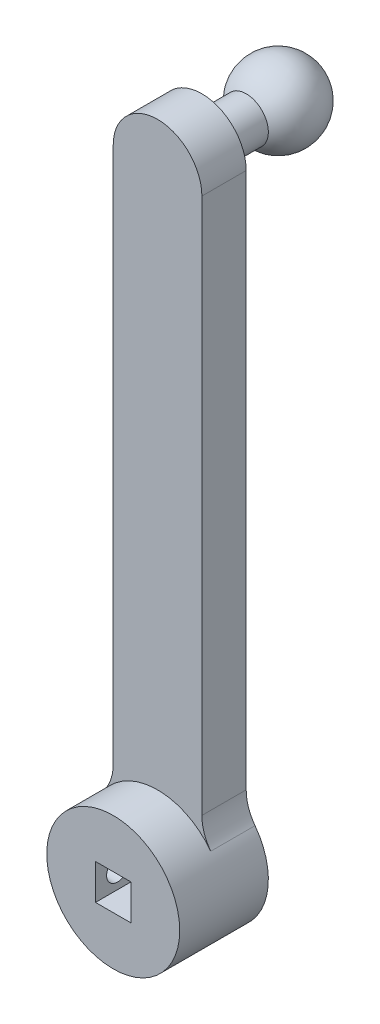
ISO-10303-21;
HEADER;
FILE_DESCRIPTION(('STEP AP214'),'2;1');
FILE_NAME('part.step','',(''),(''),'','','');
FILE_SCHEMA(('AUTOMOTIVE_DESIGN { 1 0 10303 214 1 1 1 1 }'));
ENDSEC;
DATA;
#1=APPLICATION_CONTEXT('core data for automotive mechanical design processes');
#2=APPLICATION_PROTOCOL_DEFINITION('international standard','automotive_design',2000,#1);
#3=PRODUCT_CONTEXT('',#1,'mechanical');
#4=PRODUCT('Part','Part','',(#3));
#5=PRODUCT_RELATED_PRODUCT_CATEGORY('part','',(#4));
#6=PRODUCT_DEFINITION_FORMATION('','',#4);
#7=PRODUCT_DEFINITION_CONTEXT('part definition',#1,'design');
#8=PRODUCT_DEFINITION('design','',#6,#7);
#9=PRODUCT_DEFINITION_SHAPE('','',#8);
#10=(LENGTH_UNIT() NAMED_UNIT(*) SI_UNIT(.MILLI.,.METRE.));
#11=(NAMED_UNIT(*) PLANE_ANGLE_UNIT() SI_UNIT($,.RADIAN.));
#12=(NAMED_UNIT(*) SI_UNIT($,.STERADIAN.) SOLID_ANGLE_UNIT());
#13=UNCERTAINTY_MEASURE_WITH_UNIT(LENGTH_MEASURE(1.E-05),#10,'distance_accuracy_value','');
#14=(GEOMETRIC_REPRESENTATION_CONTEXT(3) GLOBAL_UNCERTAINTY_ASSIGNED_CONTEXT((#13)) GLOBAL_UNIT_ASSIGNED_CONTEXT((#10,
#11,#12)) REPRESENTATION_CONTEXT('',''));
#15=CARTESIAN_POINT('',(0.,0.,0.));
#16=DIRECTION('',(0.,0.,1.));
#17=DIRECTION('',(1.,0.,0.));
#18=AXIS2_PLACEMENT_3D('',#15,#16,#17);
#19=CARTESIAN_POINT('',(0.,0.,12.7));
#20=DIRECTION('',(0.,0.,-1.));
#21=DIRECTION('',(-1.,0.,0.));
#22=AXIS2_PLACEMENT_3D('',#19,#20,#21);
#23=CYLINDRICAL_SURFACE('',#22,9.525);
#24=CARTESIAN_POINT('',(0.,0.,12.7));
#25=DIRECTION('',(0.,0.,1.));
#26=DIRECTION('',(1.,0.,0.));
#27=AXIS2_PLACEMENT_3D('',#24,#25,#26);
#28=CIRCLE('',#27,9.525);
#29=CARTESIAN_POINT('',(9.525,0.,12.7));
#30=VERTEX_POINT('',#29);
#31=EDGE_CURVE('E208',#30,#30,#28,.T.);
#32=ORIENTED_EDGE('',*,*,#31,.F.);
#33=EDGE_LOOP('',(#32));
#34=FACE_BOUND('',#33,.T.);
#35=CARTESIAN_POINT('',(0.,0.,6.34999999999999));
#36=DIRECTION('',(0.,0.,-1.));
#37=DIRECTION('',(-1.,0.,0.));
#38=AXIS2_PLACEMENT_3D('',#35,#36,#37);
#39=CIRCLE('',#38,9.525);
#40=CARTESIAN_POINT('',(-7.61999999999999,5.715,6.34999999999999));
#41=VERTEX_POINT('',#40);
#42=CARTESIAN_POINT('',(7.61999999999999,5.715,6.34999999999999));
#43=VERTEX_POINT('',#42);
#44=EDGE_CURVE('E212',#41,#43,#39,.T.);
#45=ORIENTED_EDGE('',*,*,#44,.F.);
#46=DIRECTION('',(0.,0.,-1.));
#47=VECTOR('',#46,1.);
#48=CARTESIAN_POINT('',(-7.61999999999999,5.715,12.7));
#49=LINE('',#48,#47);
#50=CARTESIAN_POINT('',(-7.61999999999999,5.715,0.));
#51=VERTEX_POINT('',#50);
#52=EDGE_CURVE('E222',#41,#51,#49,.T.);
#53=ORIENTED_EDGE('',*,*,#52,.T.);
#54=CARTESIAN_POINT('',(0.,0.,0.));
#55=DIRECTION('',(0.,0.,1.));
#56=DIRECTION('',(1.,0.,0.));
#57=AXIS2_PLACEMENT_3D('',#54,#55,#56);
#58=CIRCLE('',#57,9.525);
#59=CARTESIAN_POINT('',(7.61999999999999,5.715,0.));
#60=VERTEX_POINT('',#59);
#61=EDGE_CURVE('E198',#51,#60,#58,.T.);
#62=ORIENTED_EDGE('',*,*,#61,.T.);
#63=DIRECTION('',(0.,0.,-1.));
#64=VECTOR('',#63,1.);
#65=CARTESIAN_POINT('',(7.61999999999999,5.715,12.7));
#66=LINE('',#65,#64);
#67=EDGE_CURVE('E218',#60,#43,#66,.F.);
#68=ORIENTED_EDGE('',*,*,#67,.T.);
#69=EDGE_LOOP('',(#45,#53,#62,#68));
#70=FACE_BOUND('',#69,.T.);
#71=CARTESIAN_POINT('',(-9.52500000000001,0.,7.93750000000001));
#72=CARTESIAN_POINT('',(-9.52499848342203,0.0885132246484672,7.93750354898188));
#73=CARTESIAN_POINT('',(-9.52375335474776,0.177074754967653,7.94492776960527));
#74=CARTESIAN_POINT('',(-9.51890619037781,0.351713940762386,7.97441614331598));
#75=CARTESIAN_POINT('',(-9.51530198741671,0.437789236154127,7.99649375863887));
#76=CARTESIAN_POINT('',(-9.50614093330146,0.604904014480031,8.0546038098564));
#77=CARTESIAN_POINT('',(-9.50058567976088,0.685947553954255,8.09062483068177));
#78=CARTESIAN_POINT('',(-9.48813334197114,0.840830069655993,8.17556930545327));
#79=CARTESIAN_POINT('',(-9.48123641121565,0.914669868572908,8.2244912837017));
#80=CARTESIAN_POINT('',(-9.46679156586028,1.05376511007522,8.33434647822598));
#81=CARTESIAN_POINT('',(-9.45923858602434,1.1189416937447,8.39537888779394));
#82=CARTESIAN_POINT('',(-9.44437168066725,1.23817919664905,8.52750895998024));
#83=CARTESIAN_POINT('',(-9.43705777026294,1.29223941411327,8.59860725757495));
#84=CARTESIAN_POINT('',(-9.42344804257461,1.38802562475927,8.74939256353514));
#85=CARTESIAN_POINT('',(-9.41715876973189,1.42967364106674,8.82912974887103));
#86=CARTESIAN_POINT('',(-9.40638066519618,1.49895456203613,8.99459057333091));
#87=CARTESIAN_POINT('',(-9.40189171189084,1.52658841339417,9.08031380763531));
#88=CARTESIAN_POINT('',(-9.39527290895149,1.56680812989335,9.25447747453392));
#89=CARTESIAN_POINT('',(-9.39312172988419,1.57953013350098,9.34288564267839));
#90=CARTESIAN_POINT('',(-9.39135751224773,1.58998712055907,9.52060597582101));
#91=CARTESIAN_POINT('',(-9.39174429405332,1.58772316464702,9.60991807639624));
#92=CARTESIAN_POINT('',(-9.39499282328358,1.56838338748156,9.78593919190991));
#93=CARTESIAN_POINT('',(-9.39782901557512,1.55146050000001,9.87266555025122));
#94=CARTESIAN_POINT('',(-9.4056167945899,1.50352324415619,10.0420305368215));
#95=CARTESIAN_POINT('',(-9.41056845386526,1.47250839249303,10.1246690247442));
#96=CARTESIAN_POINT('',(-9.42205684377152,1.39711255126963,10.283970302885));
#97=CARTESIAN_POINT('',(-9.42860107613151,1.35266805531361,10.3606024728616));
#98=CARTESIAN_POINT('',(-9.44253203193531,1.25171963114897,10.5053792943419));
#99=CARTESIAN_POINT('',(-9.44991882335471,1.19521472961547,10.5735232601089));
#100=CARTESIAN_POINT('',(-9.46481487703663,1.070916204721,10.7002745644877));
#101=CARTESIAN_POINT('',(-9.47232452262099,1.00299136705943,10.758753259273));
#102=CARTESIAN_POINT('',(-9.48653551886919,0.858224883103339,10.8635023792925));
#103=CARTESIAN_POINT('',(-9.49323686432488,0.781383179360573,10.9097727258664));
#104=CARTESIAN_POINT('',(-9.50508571986999,0.62084325676586,10.9888034142315));
#105=CARTESIAN_POINT('',(-9.51023192188728,0.537139340733559,11.0215523912754));
#106=CARTESIAN_POINT('',(-9.51838014413039,0.365314449457734,11.0724913266812));
#107=CARTESIAN_POINT('',(-9.52138234372552,0.277193844378961,11.0906825029783));
#108=CARTESIAN_POINT('',(-9.52488017450107,0.10014578732653,11.1118150626228));
#109=CARTESIAN_POINT('',(-9.52540483163119,0.0112399680908919,11.1149330480966));
#110=CARTESIAN_POINT('',(-9.52396796257443,-0.165823755785076,11.1063015462882));
#111=CARTESIAN_POINT('',(-9.52200653204814,-0.25398168907144,11.0945526310601));
#112=CARTESIAN_POINT('',(-9.51583585105758,-0.426501671472193,11.056667720672));
#113=CARTESIAN_POINT('',(-9.51164026548832,-0.510883451424718,11.0306191576723));
#114=CARTESIAN_POINT('',(-9.50146984929153,-0.674082271886384,10.9649675809433));
#115=CARTESIAN_POINT('',(-9.49549491875132,-0.752898999602671,10.9253638060516));
#116=CARTESIAN_POINT('',(-9.48235667852028,-0.903497487812791,10.8333215358175));
#117=CARTESIAN_POINT('',(-9.47518333488259,-0.975210934345099,10.7807727258338));
#118=CARTESIAN_POINT('',(-9.46047426793857,-1.10886467679422,10.6644838047305));
#119=CARTESIAN_POINT('',(-9.45293851833932,-1.17080426220733,10.6007428807193));
#120=CARTESIAN_POINT('',(-9.43826011274762,-1.28380666508283,10.4630870569746));
#121=CARTESIAN_POINT('',(-9.43112233747063,-1.33475016330722,10.3890736048983));
#122=CARTESIAN_POINT('',(-9.41813921408956,-1.42348096703732,10.233435864597));
#123=CARTESIAN_POINT('',(-9.41229382501922,-1.46126868957883,10.1518118177305));
#124=CARTESIAN_POINT('',(-9.40259393098042,-1.52243684048544,9.98360351966429));
#125=CARTESIAN_POINT('',(-9.39873122987526,-1.54587665966795,9.89704135965563));
#126=CARTESIAN_POINT('',(-9.39341350190391,-1.57787051314921,9.72113871794418));
#127=CARTESIAN_POINT('',(-9.39195826572029,-1.58642584158582,9.63179847847014));
#128=CARTESIAN_POINT('',(-9.39162925508347,-1.58837176994007,9.45406721961387));
#129=CARTESIAN_POINT('',(-9.39272350881087,-1.58195018643949,9.36567825960469));
#130=CARTESIAN_POINT('',(-9.39730011223118,-1.5545306977376,9.19125717748776));
#131=CARTESIAN_POINT('',(-9.40078245418372,-1.53353283978143,9.10522504774191));
#132=CARTESIAN_POINT('',(-9.40973071238893,-1.47762880089276,8.93803239231918));
#133=CARTESIAN_POINT('',(-9.41519432184491,-1.44273879003127,8.85686632861442));
#134=CARTESIAN_POINT('',(-9.42749174265602,-1.3600601474866,8.70150935006127));
#135=CARTESIAN_POINT('',(-9.43432562196634,-1.31227087605534,8.62731878141368));
#136=CARTESIAN_POINT('',(-9.4486949331897,-1.20447999157632,8.48706990472657));
#137=CARTESIAN_POINT('',(-9.45623772690952,-1.14434020788196,8.42111852939532));
#138=CARTESIAN_POINT('',(-9.47111626449134,-1.01384673492644,8.30017923115842));
#139=CARTESIAN_POINT('',(-9.47845196016858,-0.943490691699523,8.24519384191477));
#140=CARTESIAN_POINT('',(-9.49214846322812,-0.79398442272158,8.14740034969304));
#141=CARTESIAN_POINT('',(-9.49850218820722,-0.71477682008334,8.10467896503628));
#142=CARTESIAN_POINT('',(-9.50944991427127,-0.550235799055655,8.0332138772727));
#143=CARTESIAN_POINT('',(-9.51404566692699,-0.46490857921706,8.00445625351439));
#144=CARTESIAN_POINT('',(-9.51995677178926,-0.316041601878834,7.96797665092957));
#145=CARTESIAN_POINT('',(-9.52183787318582,-0.253402357239518,7.95656621179387));
#146=CARTESIAN_POINT('',(-9.52436002151187,-0.127183712053081,7.94132667646859));
#147=CARTESIAN_POINT('',(-9.52500108979108,-0.063604327711395,7.93749744975279));
#148=CARTESIAN_POINT('',(-9.52500000000001,0.,7.93750000000001));
#149=B_SPLINE_CURVE_WITH_KNOTS('',3,(#71,#72,#73,#74,#75,#76,#77,#78,#79,#80,#81,#82,#83,#84,
#85,#86,#87,#88,#89,#90,#91,#92,#93,#94,#95,#96,#97,#98,#99,#100,#101,#102,#103,#104,#105,#106,
#107,#108,#109,#110,#111,#112,#113,#114,#115,#116,#117,#118,#119,#120,#121,#122,#123,#124,#125,
#126,#127,#128,#129,#130,#131,#132,#133,#134,#135,#136,#137,#138,#139,#140,#141,#142,#143,#144,
#145,#146,#147,#148),.UNSPECIFIED.,.T.,.F.,(4,2,2,2,2,2,2,2,2,2,2,2,2,2,2,2,2,2,2,2,2,2,2,2,2,2,
2,2,2,2,2,2,2,2,2,2,2,2,4),(0.,0.265307181435956,0.530858441516595,0.796192760561045,
1.06149674204849,1.32907081824581,1.5966617810786,1.86590000723139,2.13512004316376,
2.40186258960675,2.66858625743763,2.93256031317859,3.19654342291118,3.46179493461675,
3.72706786132166,3.99562808893694,4.26419004688764,4.53297727461599,4.8017420127093,
5.06735006017037,5.33294788777771,5.59693957449074,5.86094608749554,6.12728534273161,
6.39364395039471,6.66276176974839,6.93187105733725,7.19985874187026,7.46782312494503,
7.73244522546915,7.99706646829465,8.26138059573652,8.5257078344363,8.79317128962805,
9.06069647013148,9.33006917070572,9.59917277602596,9.78982197584151,9.98046789320875),.UNSPECIFIED.);
#150=CARTESIAN_POINT('',(-9.52500000000001,0.,7.93750000000001));
#151=VERTEX_POINT('',#150);
#152=EDGE_CURVE('E243',#151,#151,#149,.T.);
#153=ORIENTED_EDGE('',*,*,#152,.T.);
#154=EDGE_LOOP('',(#153));
#155=FACE_BOUND('',#154,.T.);
#156=ADVANCED_FACE('F42',(#34,#70,#155),#23,.T.);
#157=CARTESIAN_POINT('',(0.,0.,12.7));
#158=DIRECTION('',(0.,0.,1.));
#159=DIRECTION('',(1.,0.,0.));
#160=AXIS2_PLACEMENT_3D('',#157,#158,#159);
#161=PLANE('',#160);
#162=ORIENTED_EDGE('',*,*,#31,.T.);
#163=EDGE_LOOP('',(#162));
#164=FACE_BOUND('',#163,.T.);
#165=DIRECTION('',(0.,1.,0.));
#166=VECTOR('',#165,1.);
#167=CARTESIAN_POINT('',(-2.54000000000001,0.,12.7));
#168=LINE('',#167,#166);
#169=CARTESIAN_POINT('',(-2.54000000000001,-2.54,12.7));
#170=VERTEX_POINT('',#169);
#171=CARTESIAN_POINT('',(-2.54000000000001,2.54,12.7));
#172=VERTEX_POINT('',#171);
#173=EDGE_CURVE('E184',#170,#172,#168,.T.);
#174=ORIENTED_EDGE('',*,*,#173,.T.);
#175=DIRECTION('',(1.,0.,0.));
#176=VECTOR('',#175,1.);
#177=CARTESIAN_POINT('',(0.,2.54,12.7));
#178=LINE('',#177,#176);
#179=CARTESIAN_POINT('',(2.53999999999999,2.54,12.7));
#180=VERTEX_POINT('',#179);
#181=EDGE_CURVE('E163',#172,#180,#178,.T.);
#182=ORIENTED_EDGE('',*,*,#181,.T.);
#183=DIRECTION('',(0.,1.,0.));
#184=VECTOR('',#183,1.);
#185=CARTESIAN_POINT('',(2.53999999999999,0.,12.7));
#186=LINE('',#185,#184);
#187=CARTESIAN_POINT('',(2.53999999999999,-2.54,12.7));
#188=VERTEX_POINT('',#187);
#189=EDGE_CURVE('E169',#188,#180,#186,.T.);
#190=ORIENTED_EDGE('',*,*,#189,.F.);
#191=DIRECTION('',(1.,0.,0.));
#192=VECTOR('',#191,1.);
#193=CARTESIAN_POINT('',(0.,-2.54,12.7));
#194=LINE('',#193,#192);
#195=EDGE_CURVE('E188',#170,#188,#194,.T.);
#196=ORIENTED_EDGE('',*,*,#195,.F.);
#197=EDGE_LOOP('',(#174,#182,#190,#196));
#198=FACE_BOUND('',#197,.T.);
#199=ADVANCED_FACE('F296',(#164,#198),#161,.T.);
#200=CARTESIAN_POINT('',(0.,0.,0.));
#201=DIRECTION('',(0.,0.,1.));
#202=DIRECTION('',(1.,0.,0.));
#203=AXIS2_PLACEMENT_3D('',#200,#201,#202);
#204=PLANE('',#203);
#205=CARTESIAN_POINT('',(0.,86.3720761032346,0.));
#206=DIRECTION('',(0.,0.,1.));
#207=DIRECTION('',(1.,0.,0.));
#208=AXIS2_PLACEMENT_3D('',#205,#206,#207);
#209=CIRCLE('',#208,3.175);
#210=CARTESIAN_POINT('',(3.175,86.3720761032346,0.));
#211=VERTEX_POINT('',#210);
#212=EDGE_CURVE('E11',#211,#211,#209,.F.);
#213=ORIENTED_EDGE('',*,*,#212,.F.);
#214=EDGE_LOOP('',(#213));
#215=FACE_BOUND('',#214,.T.);
#216=ORIENTED_EDGE('',*,*,#61,.F.);
#217=CARTESIAN_POINT('',(-12.7,9.52499999999999,0.));
#218=DIRECTION('',(0.,0.,1.));
#219=DIRECTION('',(1.,0.,0.));
#220=AXIS2_PLACEMENT_3D('',#217,#218,#219);
#221=CIRCLE('',#220,6.35);
#222=CARTESIAN_POINT('',(-6.34999999999999,9.52499999999999,0.));
#223=VERTEX_POINT('',#222);
#224=EDGE_CURVE('E231',#51,#223,#221,.T.);
#225=ORIENTED_EDGE('',*,*,#224,.T.);
#226=DIRECTION('',(0.,1.,0.));
#227=VECTOR('',#226,1.);
#228=CARTESIAN_POINT('',(-6.34999999999999,10.1720761032346,0.));
#229=LINE('',#228,#227);
#230=CARTESIAN_POINT('',(-6.34999999999999,86.3720761032346,0.));
#231=VERTEX_POINT('',#230);
#232=EDGE_CURVE('E156',#223,#231,#229,.T.);
#233=ORIENTED_EDGE('',*,*,#232,.T.);
#234=CARTESIAN_POINT('',(0.,86.3720761032346,0.));
#235=DIRECTION('',(0.,0.,-1.));
#236=DIRECTION('',(-1.,0.,0.));
#237=AXIS2_PLACEMENT_3D('',#234,#235,#236);
#238=CIRCLE('',#237,6.35);
#239=CARTESIAN_POINT('',(6.34999999999999,86.3720761032346,0.));
#240=VERTEX_POINT('',#239);
#241=EDGE_CURVE('E142',#231,#240,#238,.T.);
#242=ORIENTED_EDGE('',*,*,#241,.T.);
#243=DIRECTION('',(0.,-1.,0.));
#244=VECTOR('',#243,1.);
#245=CARTESIAN_POINT('',(6.34999999999999,10.1720761032346,0.));
#246=LINE('',#245,#244);
#247=CARTESIAN_POINT('',(6.34999999999999,9.52499999999999,0.));
#248=VERTEX_POINT('',#247);
#249=EDGE_CURVE('E152',#240,#248,#246,.T.);
#250=ORIENTED_EDGE('',*,*,#249,.T.);
#251=CARTESIAN_POINT('',(12.7,9.52499999999999,0.));
#252=DIRECTION('',(0.,0.,1.));
#253=DIRECTION('',(1.,0.,0.));
#254=AXIS2_PLACEMENT_3D('',#251,#252,#253);
#255=CIRCLE('',#254,6.35);
#256=EDGE_CURVE('E66',#248,#60,#255,.T.);
#257=ORIENTED_EDGE('',*,*,#256,.T.);
#258=EDGE_LOOP('',(#216,#225,#233,#242,#250,#257));
#259=FACE_BOUND('',#258,.T.);
#260=ADVANCED_FACE('F294',(#215,#259),#204,.F.);
#261=CARTESIAN_POINT('',(0.,2.54,6.34999999999999));
#262=DIRECTION('',(0.,-1.,0.));
#263=DIRECTION('',(0.,0.,-1.));
#264=AXIS2_PLACEMENT_3D('',#261,#262,#263);
#265=PLANE('',#264);
#266=ORIENTED_EDGE('',*,*,#181,.F.);
#267=DIRECTION('',(0.,0.,1.));
#268=VECTOR('',#267,1.);
#269=CARTESIAN_POINT('',(-2.54000000000001,2.54,6.34999999999999));
#270=LINE('',#269,#268);
#271=CARTESIAN_POINT('',(-2.54000000000001,2.54,6.34999999999999));
#272=VERTEX_POINT('',#271);
#273=EDGE_CURVE('E180',#272,#172,#270,.T.);
#274=ORIENTED_EDGE('',*,*,#273,.F.);
#275=DIRECTION('',(1.,0.,0.));
#276=VECTOR('',#275,1.);
#277=CARTESIAN_POINT('',(0.,2.54,6.34999999999999));
#278=LINE('',#277,#276);
#279=CARTESIAN_POINT('',(2.53999999999999,2.54,6.34999999999999));
#280=VERTEX_POINT('',#279);
#281=EDGE_CURVE('E165',#272,#280,#278,.T.);
#282=ORIENTED_EDGE('',*,*,#281,.T.);
#283=DIRECTION('',(0.,0.,1.));
#284=VECTOR('',#283,1.);
#285=CARTESIAN_POINT('',(2.53999999999999,2.54,6.34999999999999));
#286=LINE('',#285,#284);
#287=EDGE_CURVE('E195',#280,#180,#286,.T.);
#288=ORIENTED_EDGE('',*,*,#287,.T.);
#289=EDGE_LOOP('',(#266,#274,#282,#288));
#290=FACE_BOUND('',#289,.T.);
#291=ADVANCED_FACE('F285',(#290),#265,.T.);
#292=CARTESIAN_POINT('',(2.53999999999999,0.,6.34999999999999));
#293=DIRECTION('',(1.,0.,0.));
#294=DIRECTION('',(0.,0.,-1.));
#295=AXIS2_PLACEMENT_3D('',#292,#293,#294);
#296=PLANE('',#295);
#297=ORIENTED_EDGE('',*,*,#189,.T.);
#298=ORIENTED_EDGE('',*,*,#287,.F.);
#299=DIRECTION('',(0.,1.,0.));
#300=VECTOR('',#299,1.);
#301=CARTESIAN_POINT('',(2.53999999999999,0.,6.34999999999999));
#302=LINE('',#301,#300);
#303=CARTESIAN_POINT('',(2.53999999999999,-2.54,6.34999999999999));
#304=VERTEX_POINT('',#303);
#305=EDGE_CURVE('E176',#304,#280,#302,.T.);
#306=ORIENTED_EDGE('',*,*,#305,.F.);
#307=DIRECTION('',(0.,0.,1.));
#308=VECTOR('',#307,1.);
#309=CARTESIAN_POINT('',(2.53999999999999,-2.54,6.34999999999999));
#310=LINE('',#309,#308);
#311=EDGE_CURVE('E199',#304,#188,#310,.T.);
#312=ORIENTED_EDGE('',*,*,#311,.T.);
#313=EDGE_LOOP('',(#297,#298,#306,#312));
#314=FACE_BOUND('',#313,.T.);
#315=ADVANCED_FACE('F281',(#314),#296,.F.);
#316=CARTESIAN_POINT('',(0.,-2.54,6.34999999999999));
#317=DIRECTION('',(0.,-1.,0.));
#318=DIRECTION('',(0.,0.,-1.));
#319=AXIS2_PLACEMENT_3D('',#316,#317,#318);
#320=PLANE('',#319);
#321=ORIENTED_EDGE('',*,*,#195,.T.);
#322=ORIENTED_EDGE('',*,*,#311,.F.);
#323=DIRECTION('',(1.,0.,0.));
#324=VECTOR('',#323,1.);
#325=CARTESIAN_POINT('',(0.,-2.54,6.34999999999999));
#326=LINE('',#325,#324);
#327=CARTESIAN_POINT('',(-2.54000000000001,-2.54,6.34999999999999));
#328=VERTEX_POINT('',#327);
#329=EDGE_CURVE('E172',#328,#304,#326,.T.);
#330=ORIENTED_EDGE('',*,*,#329,.F.);
#331=DIRECTION('',(0.,0.,1.));
#332=VECTOR('',#331,1.);
#333=CARTESIAN_POINT('',(-2.54000000000001,-2.54,6.34999999999999));
#334=LINE('',#333,#332);
#335=EDGE_CURVE('E202',#328,#170,#334,.T.);
#336=ORIENTED_EDGE('',*,*,#335,.T.);
#337=EDGE_LOOP('',(#321,#322,#330,#336));
#338=FACE_BOUND('',#337,.T.);
#339=ADVANCED_FACE('F284',(#338),#320,.F.);
#340=CARTESIAN_POINT('',(-2.54000000000001,0.,6.34999999999999));
#341=DIRECTION('',(1.,0.,0.));
#342=DIRECTION('',(0.,0.,-1.));
#343=AXIS2_PLACEMENT_3D('',#340,#341,#342);
#344=PLANE('',#343);
#345=CARTESIAN_POINT('',(-2.53999999999999,0.,9.52500000000001));
#346=DIRECTION('',(1.,0.,0.));
#347=DIRECTION('',(0.,0.,-1.));
#348=AXIS2_PLACEMENT_3D('',#345,#346,#347);
#349=CIRCLE('',#348,1.5875);
#350=CARTESIAN_POINT('',(-2.53999999999999,0.,7.93750000000001));
#351=VERTEX_POINT('',#350);
#352=EDGE_CURVE('E157',#351,#351,#349,.F.);
#353=ORIENTED_EDGE('',*,*,#352,.T.);
#354=EDGE_LOOP('',(#353));
#355=FACE_BOUND('',#354,.T.);
#356=ORIENTED_EDGE('',*,*,#173,.F.);
#357=ORIENTED_EDGE('',*,*,#335,.F.);
#358=DIRECTION('',(0.,1.,0.));
#359=VECTOR('',#358,1.);
#360=CARTESIAN_POINT('',(-2.54000000000001,0.,6.34999999999999));
#361=LINE('',#360,#359);
#362=EDGE_CURVE('E168',#328,#272,#361,.T.);
#363=ORIENTED_EDGE('',*,*,#362,.T.);
#364=ORIENTED_EDGE('',*,*,#273,.T.);
#365=EDGE_LOOP('',(#356,#357,#363,#364));
#366=FACE_BOUND('',#365,.T.);
#367=ADVANCED_FACE('F279',(#355,#366),#344,.T.);
#368=CARTESIAN_POINT('',(0.,0.,6.34999999999999));
#369=DIRECTION('',(0.,0.,1.));
#370=DIRECTION('',(1.,0.,0.));
#371=AXIS2_PLACEMENT_3D('',#368,#369,#370);
#372=PLANE('',#371);
#373=ORIENTED_EDGE('',*,*,#281,.F.);
#374=ORIENTED_EDGE('',*,*,#362,.F.);
#375=ORIENTED_EDGE('',*,*,#329,.T.);
#376=ORIENTED_EDGE('',*,*,#305,.T.);
#377=EDGE_LOOP('',(#373,#374,#375,#376));
#378=FACE_BOUND('',#377,.T.);
#379=ADVANCED_FACE('F271',(#378),#372,.T.);
#380=CARTESIAN_POINT('',(0.,86.3720761032346,6.34999999999999));
#381=DIRECTION('',(0.,0.,-1.));
#382=DIRECTION('',(-1.,0.,0.));
#383=AXIS2_PLACEMENT_3D('',#380,#381,#382);
#384=CYLINDRICAL_SURFACE('',#383,6.35);
#385=ORIENTED_EDGE('',*,*,#241,.F.);
#386=DIRECTION('',(0.,0.,-1.));
#387=VECTOR('',#386,1.);
#388=CARTESIAN_POINT('',(-6.34999999999999,86.3720761032346,6.34999999999999));
#389=LINE('',#388,#387);
#390=CARTESIAN_POINT('',(-6.34999999999999,86.3720761032346,6.34999999999999));
#391=VERTEX_POINT('',#390);
#392=EDGE_CURVE('E126',#391,#231,#389,.T.);
#393=ORIENTED_EDGE('',*,*,#392,.F.);
#394=CARTESIAN_POINT('',(0.,86.3720761032346,6.34999999999999));
#395=DIRECTION('',(0.,0.,-1.));
#396=DIRECTION('',(-1.,0.,0.));
#397=AXIS2_PLACEMENT_3D('',#394,#395,#396);
#398=CIRCLE('',#397,6.35);
#399=CARTESIAN_POINT('',(6.34999999999999,86.3720761032346,6.34999999999999));
#400=VERTEX_POINT('',#399);
#401=EDGE_CURVE('E134',#391,#400,#398,.T.);
#402=ORIENTED_EDGE('',*,*,#401,.T.);
#403=DIRECTION('',(0.,0.,-1.));
#404=VECTOR('',#403,1.);
#405=CARTESIAN_POINT('',(6.34999999999999,86.3720761032346,6.34999999999999));
#406=LINE('',#405,#404);
#407=EDGE_CURVE('E144',#400,#240,#406,.T.);
#408=ORIENTED_EDGE('',*,*,#407,.T.);
#409=EDGE_LOOP('',(#385,#393,#402,#408));
#410=FACE_BOUND('',#409,.T.);
#411=ADVANCED_FACE('F139',(#410),#384,.T.);
#412=CARTESIAN_POINT('',(-6.34999999999999,10.1720761032346,6.34999999999999));
#413=DIRECTION('',(-1.,0.,0.));
#414=DIRECTION('',(0.,0.,1.));
#415=AXIS2_PLACEMENT_3D('',#412,#413,#414);
#416=PLANE('',#415);
#417=ORIENTED_EDGE('',*,*,#232,.F.);
#418=DIRECTION('',(0.,0.,-1.));
#419=VECTOR('',#418,1.);
#420=CARTESIAN_POINT('',(-6.34999999999999,9.52499999999999,6.34999999999999));
#421=LINE('',#420,#419);
#422=CARTESIAN_POINT('',(-6.34999999999999,9.52499999999999,6.34999999999999));
#423=VERTEX_POINT('',#422);
#424=EDGE_CURVE('E129',#223,#423,#421,.F.);
#425=ORIENTED_EDGE('',*,*,#424,.T.);
#426=DIRECTION('',(0.,1.,0.));
#427=VECTOR('',#426,1.);
#428=CARTESIAN_POINT('',(-6.34999999999999,7.09951582856183,6.34999999999999));
#429=LINE('',#428,#427);
#430=EDGE_CURVE('E122',#423,#391,#429,.T.);
#431=ORIENTED_EDGE('',*,*,#430,.T.);
#432=ORIENTED_EDGE('',*,*,#392,.T.);
#433=EDGE_LOOP('',(#417,#425,#431,#432));
#434=FACE_BOUND('',#433,.T.);
#435=ADVANCED_FACE('F125',(#434),#416,.T.);
#436=CARTESIAN_POINT('',(6.34999999999999,10.1720761032346,6.34999999999999));
#437=DIRECTION('',(1.,0.,0.));
#438=DIRECTION('',(0.,0.,-1.));
#439=AXIS2_PLACEMENT_3D('',#436,#437,#438);
#440=PLANE('',#439);
#441=DIRECTION('',(0.,-1.,0.));
#442=VECTOR('',#441,1.);
#443=CARTESIAN_POINT('',(6.34999999999999,10.1720761032346,6.34999999999999));
#444=LINE('',#443,#442);
#445=CARTESIAN_POINT('',(6.34999999999999,9.52499999999999,6.34999999999999));
#446=VERTEX_POINT('',#445);
#447=EDGE_CURVE('E135',#400,#446,#444,.T.);
#448=ORIENTED_EDGE('',*,*,#447,.T.);
#449=DIRECTION('',(0.,0.,-1.));
#450=VECTOR('',#449,1.);
#451=CARTESIAN_POINT('',(6.34999999999999,9.52499999999999,6.34999999999999));
#452=LINE('',#451,#450);
#453=EDGE_CURVE('E228',#446,#248,#452,.T.);
#454=ORIENTED_EDGE('',*,*,#453,.T.);
#455=ORIENTED_EDGE('',*,*,#249,.F.);
#456=ORIENTED_EDGE('',*,*,#407,.F.);
#457=EDGE_LOOP('',(#448,#454,#455,#456));
#458=FACE_BOUND('',#457,.T.);
#459=ADVANCED_FACE('F268',(#458),#440,.T.);
#460=CARTESIAN_POINT('',(0.,86.3720761032346,6.34999999999999));
#461=DIRECTION('',(0.,0.,-1.));
#462=DIRECTION('',(-1.,0.,0.));
#463=AXIS2_PLACEMENT_3D('',#460,#461,#462);
#464=PLANE('',#463);
#465=ORIENTED_EDGE('',*,*,#430,.F.);
#466=CARTESIAN_POINT('',(-12.7,9.52499999999999,6.34999999999999));
#467=DIRECTION('',(0.,0.,-1.));
#468=DIRECTION('',(-1.,0.,0.));
#469=AXIS2_PLACEMENT_3D('',#466,#467,#468);
#470=CIRCLE('',#469,6.35);
#471=EDGE_CURVE('E234',#423,#41,#470,.T.);
#472=ORIENTED_EDGE('',*,*,#471,.T.);
#473=ORIENTED_EDGE('',*,*,#44,.T.);
#474=CARTESIAN_POINT('',(12.7,9.52499999999999,6.34999999999999));
#475=DIRECTION('',(0.,0.,-1.));
#476=DIRECTION('',(-1.,0.,0.));
#477=AXIS2_PLACEMENT_3D('',#474,#475,#476);
#478=CIRCLE('',#477,6.35);
#479=EDGE_CURVE('E52',#43,#446,#478,.T.);
#480=ORIENTED_EDGE('',*,*,#479,.T.);
#481=ORIENTED_EDGE('',*,*,#447,.F.);
#482=ORIENTED_EDGE('',*,*,#401,.F.);
#483=EDGE_LOOP('',(#465,#472,#473,#480,#481,#482));
#484=FACE_BOUND('',#483,.T.);
#485=ADVANCED_FACE('F146',(#484),#464,.F.);
#486=CARTESIAN_POINT('',(-12.7,9.52499999999999,12.7));
#487=DIRECTION('',(0.,0.,-1.));
#488=DIRECTION('',(-1.,0.,0.));
#489=AXIS2_PLACEMENT_3D('',#486,#487,#488);
#490=CYLINDRICAL_SURFACE('',#489,6.35);
#491=ORIENTED_EDGE('',*,*,#471,.F.);
#492=ORIENTED_EDGE('',*,*,#424,.F.);
#493=ORIENTED_EDGE('',*,*,#224,.F.);
#494=ORIENTED_EDGE('',*,*,#52,.F.);
#495=EDGE_LOOP('',(#491,#492,#493,#494));
#496=FACE_BOUND('',#495,.T.);
#497=ADVANCED_FACE('F267',(#496),#490,.F.);
#498=CARTESIAN_POINT('',(12.7,9.52499999999999,12.7));
#499=DIRECTION('',(0.,0.,-1.));
#500=DIRECTION('',(-1.,0.,0.));
#501=AXIS2_PLACEMENT_3D('',#498,#499,#500);
#502=CYLINDRICAL_SURFACE('',#501,6.35);
#503=ORIENTED_EDGE('',*,*,#479,.F.);
#504=ORIENTED_EDGE('',*,*,#67,.F.);
#505=ORIENTED_EDGE('',*,*,#256,.F.);
#506=ORIENTED_EDGE('',*,*,#453,.F.);
#507=EDGE_LOOP('',(#503,#504,#505,#506));
#508=FACE_BOUND('',#507,.T.);
#509=ADVANCED_FACE('F307',(#508),#502,.F.);
#510=CARTESIAN_POINT('',(-9.52600000000001,0.,9.52500000000001));
#511=DIRECTION('',(1.,0.,0.));
#512=DIRECTION('',(0.,0.,-1.));
#513=AXIS2_PLACEMENT_3D('',#510,#511,#512);
#514=CYLINDRICAL_SURFACE('',#513,1.5875);
#515=ORIENTED_EDGE('',*,*,#352,.F.);
#516=EDGE_LOOP('',(#515));
#517=FACE_BOUND('',#516,.T.);
#518=ORIENTED_EDGE('',*,*,#152,.F.);
#519=EDGE_LOOP('',(#518));
#520=FACE_BOUND('',#519,.T.);
#521=ADVANCED_FACE('F260',(#517,#520),#514,.F.);
#522=CARTESIAN_POINT('',(0.,86.3720761032346,-6.34999999999999));
#523=DIRECTION('',(0.,0.,1.));
#524=DIRECTION('',(1.,0.,0.));
#525=AXIS2_PLACEMENT_3D('',#522,#523,#524);
#526=CYLINDRICAL_SURFACE('',#525,3.175);
#527=CARTESIAN_POINT('',(0.,86.3720761032346,-6.34999999999999));
#528=DIRECTION('',(0.,0.,-1.));
#529=DIRECTION('',(-1.,0.,0.));
#530=AXIS2_PLACEMENT_3D('',#527,#528,#529);
#531=CIRCLE('',#530,3.175);
#532=CARTESIAN_POINT('',(-3.175,86.3720761032346,-6.34999999999999));
#533=VERTEX_POINT('',#532);
#534=EDGE_CURVE('E46',#533,#533,#531,.T.);
#535=ORIENTED_EDGE('',*,*,#534,.F.);
#536=EDGE_LOOP('',(#535));
#537=FACE_BOUND('',#536,.T.);
#538=ORIENTED_EDGE('',*,*,#212,.T.);
#539=EDGE_LOOP('',(#538));
#540=FACE_BOUND('',#539,.T.);
#541=ADVANCED_FACE('F313',(#537,#540),#526,.T.);
#542=CARTESIAN_POINT('',(0.,86.3720761032346,-10.93390625));
#543=DIRECTION('',(0.,0.,1.));
#544=DIRECTION('',(1.,0.,0.));
#545=AXIS2_PLACEMENT_3D('',#542,#543,#544);
#546=SPHERICAL_SURFACE('',#545,5.57609375);
#547=ORIENTED_EDGE('',*,*,#534,.T.);
#548=EDGE_LOOP('',(#547));
#549=FACE_BOUND('',#548,.T.);
#550=ADVANCED_FACE('F44',(#549),#546,.T.);
#551=CLOSED_SHELL('',(#156,#199,#260,#291,#315,#339,#367,#379,#411,#435,#459,#485,#497,#509,
#521,#541,#550));
#552=MANIFOLD_SOLID_BREP('B2',#551);
#553=ADVANCED_BREP_SHAPE_REPRESENTATION('',(#18,#552),#14);
#554=SHAPE_DEFINITION_REPRESENTATION(#9,#553);
ENDSEC;
END-ISO-10303-21;
